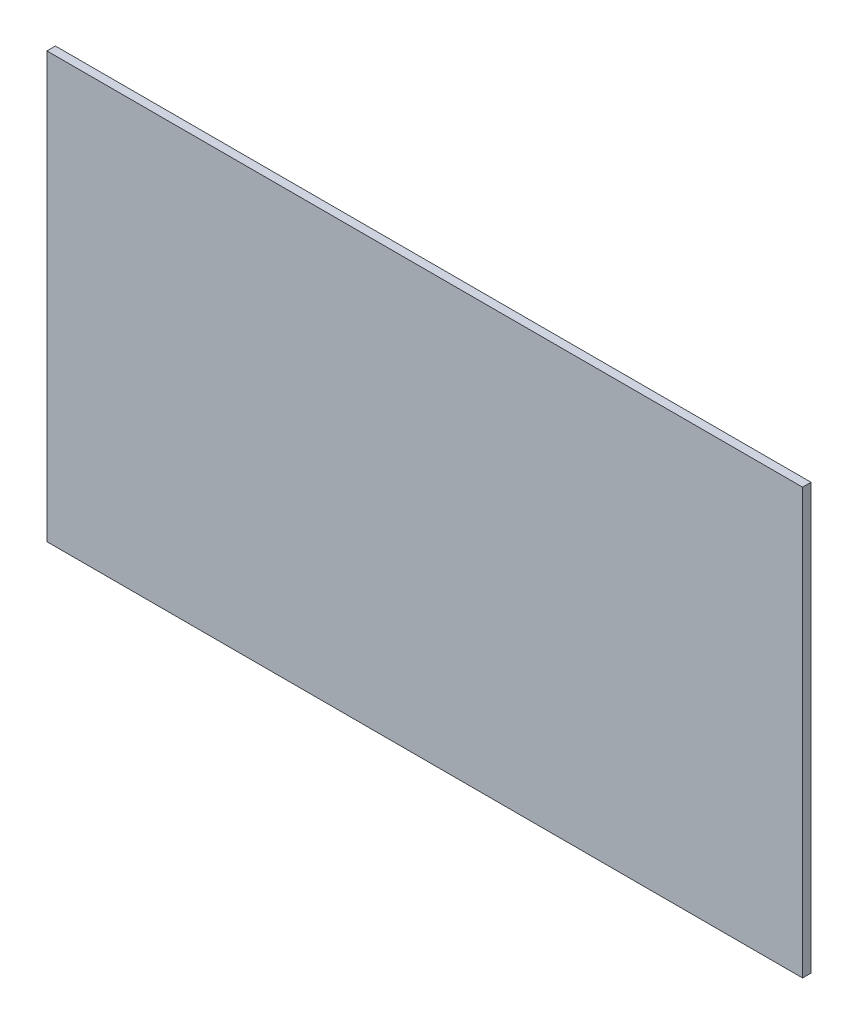
ISO-10303-21;
HEADER;
FILE_DESCRIPTION(('STEP AP214'),'2;1');
FILE_NAME('part.step','',(''),(''),'','','');
FILE_SCHEMA(('AUTOMOTIVE_DESIGN { 1 0 10303 214 1 1 1 1 }'));
ENDSEC;
DATA;
#1=APPLICATION_CONTEXT('core data for automotive mechanical design processes');
#2=APPLICATION_PROTOCOL_DEFINITION('international standard','automotive_design',2000,#1);
#3=PRODUCT_CONTEXT('',#1,'mechanical');
#4=PRODUCT('Part','Part','',(#3));
#5=PRODUCT_RELATED_PRODUCT_CATEGORY('part','',(#4));
#6=PRODUCT_DEFINITION_FORMATION('','',#4);
#7=PRODUCT_DEFINITION_CONTEXT('part definition',#1,'design');
#8=PRODUCT_DEFINITION('design','',#6,#7);
#9=PRODUCT_DEFINITION_SHAPE('','',#8);
#10=(LENGTH_UNIT() NAMED_UNIT(*) SI_UNIT(.MILLI.,.METRE.));
#11=(NAMED_UNIT(*) PLANE_ANGLE_UNIT() SI_UNIT($,.RADIAN.));
#12=(NAMED_UNIT(*) SI_UNIT($,.STERADIAN.) SOLID_ANGLE_UNIT());
#13=UNCERTAINTY_MEASURE_WITH_UNIT(LENGTH_MEASURE(1.E-05),#10,'distance_accuracy_value','');
#14=(GEOMETRIC_REPRESENTATION_CONTEXT(3) GLOBAL_UNCERTAINTY_ASSIGNED_CONTEXT((#13)) GLOBAL_UNIT_ASSIGNED_CONTEXT((#10,
#11,#12)) REPRESENTATION_CONTEXT('',''));
#15=CARTESIAN_POINT('',(0.,0.,0.));
#16=DIRECTION('',(0.,0.,1.));
#17=DIRECTION('',(1.,0.,0.));
#18=AXIS2_PLACEMENT_3D('',#15,#16,#17);
#19=CARTESIAN_POINT('',(-672.394789533148,478.828935534417,18.25625));
#20=DIRECTION('',(1.,0.,0.));
#21=DIRECTION('',(0.,1.,0.));
#22=AXIS2_PLACEMENT_3D('',#19,#20,#21);
#23=PLANE('',#22);
#24=DIRECTION('',(0.,-1.,0.));
#25=VECTOR('',#24,1.);
#26=CARTESIAN_POINT('',(-672.394789533148,478.828935534417,0.));
#27=LINE('',#26,#25);
#28=CARTESIAN_POINT('',(-672.394789533148,478.828935534417,0.));
#29=VERTEX_POINT('',#28);
#30=CARTESIAN_POINT('',(-672.394789533148,-435.571064465583,0.));
#31=VERTEX_POINT('',#30);
#32=EDGE_CURVE('E97',#29,#31,#27,.T.);
#33=ORIENTED_EDGE('',*,*,#32,.T.);
#34=DIRECTION('',(0.,0.,-1.));
#35=VECTOR('',#34,1.);
#36=CARTESIAN_POINT('',(-672.394789533148,-435.571064465583,18.25625));
#37=LINE('',#36,#35);
#38=CARTESIAN_POINT('',(-672.394789533148,-435.571064465583,18.25625));
#39=VERTEX_POINT('',#38);
#40=EDGE_CURVE('E11',#39,#31,#37,.T.);
#41=ORIENTED_EDGE('',*,*,#40,.F.);
#42=DIRECTION('',(0.,-1.,0.));
#43=VECTOR('',#42,1.);
#44=CARTESIAN_POINT('',(-672.394789533148,478.828935534417,18.25625));
#45=LINE('',#44,#43);
#46=CARTESIAN_POINT('',(-672.394789533148,478.828935534417,18.25625));
#47=VERTEX_POINT('',#46);
#48=EDGE_CURVE('E85',#47,#39,#45,.T.);
#49=ORIENTED_EDGE('',*,*,#48,.F.);
#50=DIRECTION('',(0.,0.,-1.));
#51=VECTOR('',#50,1.);
#52=CARTESIAN_POINT('',(-672.394789533148,478.828935534417,18.25625));
#53=LINE('',#52,#51);
#54=EDGE_CURVE('E93',#47,#29,#53,.T.);
#55=ORIENTED_EDGE('',*,*,#54,.T.);
#56=EDGE_LOOP('',(#33,#41,#49,#55));
#57=FACE_BOUND('',#56,.T.);
#58=ADVANCED_FACE('F34',(#57),#23,.F.);
#59=CARTESIAN_POINT('',(-672.394789533148,-435.571064465583,18.25625));
#60=DIRECTION('',(0.,1.,0.));
#61=DIRECTION('',(0.,0.,1.));
#62=AXIS2_PLACEMENT_3D('',#59,#60,#61);
#63=PLANE('',#62);
#64=DIRECTION('',(1.,0.,0.));
#65=VECTOR('',#64,1.);
#66=CARTESIAN_POINT('',(-672.394789533148,-435.571064465583,0.));
#67=LINE('',#66,#65);
#68=CARTESIAN_POINT('',(953.205210466852,-435.571064465583,0.));
#69=VERTEX_POINT('',#68);
#70=EDGE_CURVE('E89',#31,#69,#67,.T.);
#71=ORIENTED_EDGE('',*,*,#70,.T.);
#72=DIRECTION('',(0.,0.,-1.));
#73=VECTOR('',#72,1.);
#74=CARTESIAN_POINT('',(953.205210466852,-435.571064465583,18.25625));
#75=LINE('',#74,#73);
#76=CARTESIAN_POINT('',(953.205210466852,-435.571064465583,18.25625));
#77=VERTEX_POINT('',#76);
#78=EDGE_CURVE('E42',#77,#69,#75,.T.);
#79=ORIENTED_EDGE('',*,*,#78,.F.);
#80=DIRECTION('',(1.,0.,0.));
#81=VECTOR('',#80,1.);
#82=CARTESIAN_POINT('',(-672.394789533148,-435.571064465583,18.25625));
#83=LINE('',#82,#81);
#84=EDGE_CURVE('E80',#39,#77,#83,.T.);
#85=ORIENTED_EDGE('',*,*,#84,.F.);
#86=ORIENTED_EDGE('',*,*,#40,.T.);
#87=EDGE_LOOP('',(#71,#79,#85,#86));
#88=FACE_BOUND('',#87,.T.);
#89=ADVANCED_FACE('F88',(#88),#63,.F.);
#90=CARTESIAN_POINT('',(953.205210466852,478.828935534417,18.25625));
#91=DIRECTION('',(-1.,0.,0.));
#92=DIRECTION('',(0.,-1.,0.));
#93=AXIS2_PLACEMENT_3D('',#90,#91,#92);
#94=PLANE('',#93);
#95=DIRECTION('',(0.,1.,0.));
#96=VECTOR('',#95,1.);
#97=CARTESIAN_POINT('',(953.205210466852,478.828935534417,0.));
#98=LINE('',#97,#96);
#99=CARTESIAN_POINT('',(953.205210466852,478.828935534417,0.));
#100=VERTEX_POINT('',#99);
#101=EDGE_CURVE('E67',#69,#100,#98,.T.);
#102=ORIENTED_EDGE('',*,*,#101,.T.);
#103=DIRECTION('',(0.,0.,-1.));
#104=VECTOR('',#103,1.);
#105=CARTESIAN_POINT('',(953.205210466852,478.828935534417,18.25625));
#106=LINE('',#105,#104);
#107=CARTESIAN_POINT('',(953.205210466852,478.828935534417,18.25625));
#108=VERTEX_POINT('',#107);
#109=EDGE_CURVE('E90',#108,#100,#106,.T.);
#110=ORIENTED_EDGE('',*,*,#109,.F.);
#111=DIRECTION('',(0.,1.,0.));
#112=VECTOR('',#111,1.);
#113=CARTESIAN_POINT('',(953.205210466852,478.828935534417,18.25625));
#114=LINE('',#113,#112);
#115=EDGE_CURVE('E83',#77,#108,#114,.T.);
#116=ORIENTED_EDGE('',*,*,#115,.F.);
#117=ORIENTED_EDGE('',*,*,#78,.T.);
#118=EDGE_LOOP('',(#102,#110,#116,#117));
#119=FACE_BOUND('',#118,.T.);
#120=ADVANCED_FACE('F91',(#119),#94,.F.);
#121=CARTESIAN_POINT('',(-672.394789533148,478.828935534417,18.25625));
#122=DIRECTION('',(0.,-1.,0.));
#123=DIRECTION('',(0.,0.,-1.));
#124=AXIS2_PLACEMENT_3D('',#121,#122,#123);
#125=PLANE('',#124);
#126=DIRECTION('',(-1.,0.,0.));
#127=VECTOR('',#126,1.);
#128=CARTESIAN_POINT('',(-672.394789533148,478.828935534417,0.));
#129=LINE('',#128,#127);
#130=EDGE_CURVE('E73',#100,#29,#129,.T.);
#131=ORIENTED_EDGE('',*,*,#130,.T.);
#132=ORIENTED_EDGE('',*,*,#54,.F.);
#133=DIRECTION('',(-1.,0.,0.));
#134=VECTOR('',#133,1.);
#135=CARTESIAN_POINT('',(-672.394789533148,478.828935534417,18.25625));
#136=LINE('',#135,#134);
#137=EDGE_CURVE('E50',#108,#47,#136,.T.);
#138=ORIENTED_EDGE('',*,*,#137,.F.);
#139=ORIENTED_EDGE('',*,*,#109,.T.);
#140=EDGE_LOOP('',(#131,#132,#138,#139));
#141=FACE_BOUND('',#140,.T.);
#142=ADVANCED_FACE('F104',(#141),#125,.F.);
#143=CARTESIAN_POINT('',(0.,0.,18.25625));
#144=DIRECTION('',(0.,0.,1.));
#145=DIRECTION('',(1.,0.,0.));
#146=AXIS2_PLACEMENT_3D('',#143,#144,#145);
#147=PLANE('',#146);
#148=ORIENTED_EDGE('',*,*,#48,.T.);
#149=ORIENTED_EDGE('',*,*,#84,.T.);
#150=ORIENTED_EDGE('',*,*,#115,.T.);
#151=ORIENTED_EDGE('',*,*,#137,.T.);
#152=EDGE_LOOP('',(#148,#149,#150,#151));
#153=FACE_BOUND('',#152,.T.);
#154=ADVANCED_FACE('F81',(#153),#147,.T.);
#155=CARTESIAN_POINT('',(0.,0.,0.));
#156=DIRECTION('',(0.,0.,1.));
#157=DIRECTION('',(1.,0.,0.));
#158=AXIS2_PLACEMENT_3D('',#155,#156,#157);
#159=PLANE('',#158);
#160=ORIENTED_EDGE('',*,*,#32,.F.);
#161=ORIENTED_EDGE('',*,*,#130,.F.);
#162=ORIENTED_EDGE('',*,*,#101,.F.);
#163=ORIENTED_EDGE('',*,*,#70,.F.);
#164=EDGE_LOOP('',(#160,#161,#162,#163));
#165=FACE_BOUND('',#164,.T.);
#166=ADVANCED_FACE('F107',(#165),#159,.F.);
#167=CLOSED_SHELL('',(#58,#89,#120,#142,#154,#166));
#168=MANIFOLD_SOLID_BREP('B2',#167);
#169=ADVANCED_BREP_SHAPE_REPRESENTATION('',(#18,#168),#14);
#170=SHAPE_DEFINITION_REPRESENTATION(#9,#169);
ENDSEC;
END-ISO-10303-21;
